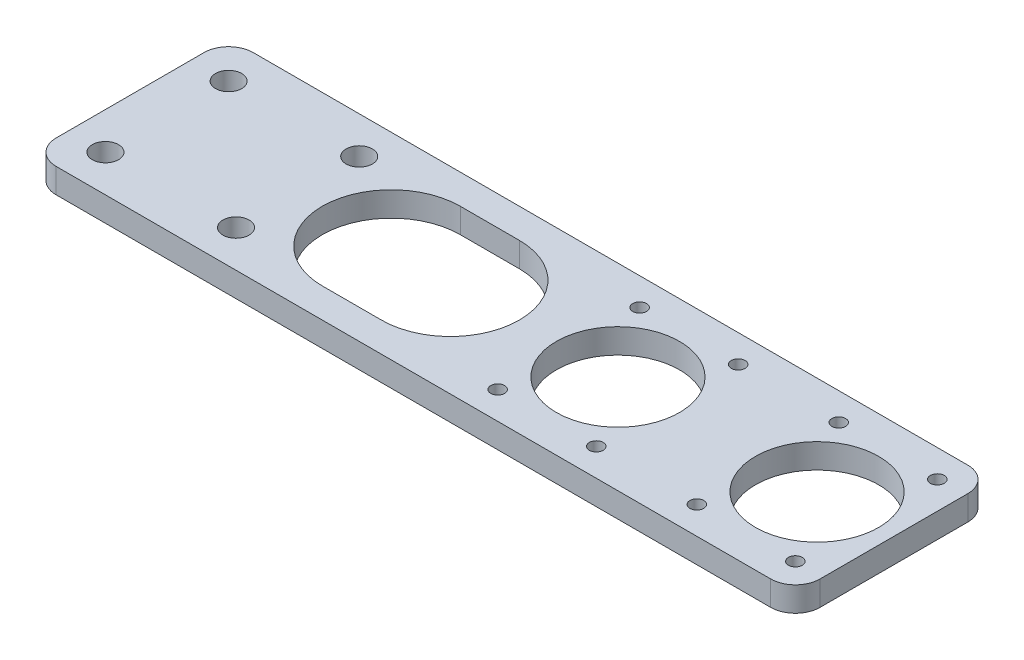
ISO-10303-21;
HEADER;
FILE_DESCRIPTION(('STEP AP214'),'2;1');
FILE_NAME('part.step','',(''),(''),'','','');
FILE_SCHEMA(('AUTOMOTIVE_DESIGN { 1 0 10303 214 1 1 1 1 }'));
ENDSEC;
DATA;
#1=APPLICATION_CONTEXT('core data for automotive mechanical design processes');
#2=APPLICATION_PROTOCOL_DEFINITION('international standard','automotive_design',2000,#1);
#3=PRODUCT_CONTEXT('',#1,'mechanical');
#4=PRODUCT('Part','Part','',(#3));
#5=PRODUCT_RELATED_PRODUCT_CATEGORY('part','',(#4));
#6=PRODUCT_DEFINITION_FORMATION('','',#4);
#7=PRODUCT_DEFINITION_CONTEXT('part definition',#1,'design');
#8=PRODUCT_DEFINITION('design','',#6,#7);
#9=PRODUCT_DEFINITION_SHAPE('','',#8);
#10=(LENGTH_UNIT() NAMED_UNIT(*) SI_UNIT(.MILLI.,.METRE.));
#11=(NAMED_UNIT(*) PLANE_ANGLE_UNIT() SI_UNIT($,.RADIAN.));
#12=(NAMED_UNIT(*) SI_UNIT($,.STERADIAN.) SOLID_ANGLE_UNIT());
#13=UNCERTAINTY_MEASURE_WITH_UNIT(LENGTH_MEASURE(1.E-05),#10,'distance_accuracy_value','');
#14=(GEOMETRIC_REPRESENTATION_CONTEXT(3) GLOBAL_UNCERTAINTY_ASSIGNED_CONTEXT((#13)) GLOBAL_UNIT_ASSIGNED_CONTEXT((#10,
#11,#12)) REPRESENTATION_CONTEXT('',''));
#15=CARTESIAN_POINT('',(0.,0.,0.));
#16=DIRECTION('',(0.,0.,1.));
#17=DIRECTION('',(1.,0.,0.));
#18=AXIS2_PLACEMENT_3D('',#15,#16,#17);
#19=CARTESIAN_POINT('',(77.47,6.35,-19.05));
#20=DIRECTION('',(0.,-1.,0.));
#21=DIRECTION('',(0.,0.,-1.));
#22=AXIS2_PLACEMENT_3D('',#19,#20,#21);
#23=PLANE('',#22);
#24=CARTESIAN_POINT('',(76.708,6.35,18.288));
#25=DIRECTION('',(0.,1.,0.));
#26=DIRECTION('',(0.,0.,1.));
#27=AXIS2_PLACEMENT_3D('',#24,#25,#26);
#28=CIRCLE('',#27,1.77800000000001);
#29=CARTESIAN_POINT('',(76.708,6.35,20.066));
#30=VERTEX_POINT('',#29);
#31=EDGE_CURVE('E183',#30,#30,#28,.T.);
#32=ORIENTED_EDGE('',*,*,#31,.F.);
#33=EDGE_LOOP('',(#32));
#34=FACE_BOUND('',#33,.T.);
#35=CARTESIAN_POINT('',(51.308,6.35,18.288));
#36=DIRECTION('',(0.,1.,0.));
#37=DIRECTION('',(0.,0.,1.));
#38=AXIS2_PLACEMENT_3D('',#35,#36,#37);
#39=CIRCLE('',#38,1.778);
#40=CARTESIAN_POINT('',(51.308,6.35,20.066));
#41=VERTEX_POINT('',#40);
#42=EDGE_CURVE('E189',#41,#41,#39,.T.);
#43=ORIENTED_EDGE('',*,*,#42,.F.);
#44=EDGE_LOOP('',(#43));
#45=FACE_BOUND('',#44,.T.);
#46=CARTESIAN_POINT('',(25.4,6.35,18.288));
#47=DIRECTION('',(0.,1.,0.));
#48=DIRECTION('',(0.,0.,1.));
#49=AXIS2_PLACEMENT_3D('',#46,#47,#48);
#50=CIRCLE('',#49,1.77800000000001);
#51=CARTESIAN_POINT('',(25.4,6.35,20.066));
#52=VERTEX_POINT('',#51);
#53=EDGE_CURVE('E195',#52,#52,#50,.T.);
#54=ORIENTED_EDGE('',*,*,#53,.F.);
#55=EDGE_LOOP('',(#54));
#56=FACE_BOUND('',#55,.T.);
#57=CARTESIAN_POINT('',(0.,6.35,18.288));
#58=DIRECTION('',(0.,1.,0.));
#59=DIRECTION('',(0.,0.,1.));
#60=AXIS2_PLACEMENT_3D('',#57,#58,#59);
#61=CIRCLE('',#60,1.778);
#62=CARTESIAN_POINT('',(0.,6.35,20.066));
#63=VERTEX_POINT('',#62);
#64=EDGE_CURVE('E201',#63,#63,#61,.T.);
#65=ORIENTED_EDGE('',*,*,#64,.F.);
#66=EDGE_LOOP('',(#65));
#67=FACE_BOUND('',#66,.T.);
#68=CARTESIAN_POINT('',(76.708,6.35,-18.288));
#69=DIRECTION('',(0.,1.,0.));
#70=DIRECTION('',(0.,0.,1.));
#71=AXIS2_PLACEMENT_3D('',#68,#69,#70);
#72=CIRCLE('',#71,1.77800000000001);
#73=CARTESIAN_POINT('',(76.708,6.35,-16.51));
#74=VERTEX_POINT('',#73);
#75=EDGE_CURVE('E207',#74,#74,#72,.T.);
#76=ORIENTED_EDGE('',*,*,#75,.F.);
#77=EDGE_LOOP('',(#76));
#78=FACE_BOUND('',#77,.T.);
#79=CARTESIAN_POINT('',(51.308,6.35,-18.288));
#80=DIRECTION('',(0.,1.,0.));
#81=DIRECTION('',(0.,0.,1.));
#82=AXIS2_PLACEMENT_3D('',#79,#80,#81);
#83=CIRCLE('',#82,1.778);
#84=CARTESIAN_POINT('',(51.308,6.35,-16.51));
#85=VERTEX_POINT('',#84);
#86=EDGE_CURVE('E213',#85,#85,#83,.T.);
#87=ORIENTED_EDGE('',*,*,#86,.F.);
#88=EDGE_LOOP('',(#87));
#89=FACE_BOUND('',#88,.T.);
#90=CARTESIAN_POINT('',(25.4,6.35,-18.288));
#91=DIRECTION('',(0.,1.,0.));
#92=DIRECTION('',(0.,0.,1.));
#93=AXIS2_PLACEMENT_3D('',#90,#91,#92);
#94=CIRCLE('',#93,1.77800000000001);
#95=CARTESIAN_POINT('',(25.4,6.35,-16.51));
#96=VERTEX_POINT('',#95);
#97=EDGE_CURVE('E219',#96,#96,#94,.T.);
#98=ORIENTED_EDGE('',*,*,#97,.F.);
#99=EDGE_LOOP('',(#98));
#100=FACE_BOUND('',#99,.T.);
#101=CARTESIAN_POINT('',(0.,6.35,-18.288));
#102=DIRECTION('',(0.,1.,0.));
#103=DIRECTION('',(0.,0.,1.));
#104=AXIS2_PLACEMENT_3D('',#101,#102,#103);
#105=CIRCLE('',#104,1.778);
#106=CARTESIAN_POINT('',(0.,6.35,-16.51));
#107=VERTEX_POINT('',#106);
#108=EDGE_CURVE('E225',#107,#107,#105,.T.);
#109=ORIENTED_EDGE('',*,*,#108,.F.);
#110=EDGE_LOOP('',(#109));
#111=FACE_BOUND('',#110,.T.);
#112=CARTESIAN_POINT('',(64.008,6.35,0.));
#113=DIRECTION('',(0.,1.,0.));
#114=DIRECTION('',(0.,0.,1.));
#115=AXIS2_PLACEMENT_3D('',#112,#113,#114);
#116=CIRCLE('',#115,15.875);
#117=CARTESIAN_POINT('',(64.008,6.35,15.875));
#118=VERTEX_POINT('',#117);
#119=EDGE_CURVE('E231',#118,#118,#116,.T.);
#120=ORIENTED_EDGE('',*,*,#119,.F.);
#121=EDGE_LOOP('',(#120));
#122=FACE_BOUND('',#121,.T.);
#123=CARTESIAN_POINT('',(12.7,6.35,0.));
#124=DIRECTION('',(0.,1.,0.));
#125=DIRECTION('',(0.,0.,1.));
#126=AXIS2_PLACEMENT_3D('',#123,#124,#125);
#127=CIRCLE('',#126,15.875);
#128=CARTESIAN_POINT('',(12.7,6.35,15.875));
#129=VERTEX_POINT('',#128);
#130=EDGE_CURVE('E237',#129,#129,#127,.T.);
#131=ORIENTED_EDGE('',*,*,#130,.F.);
#132=EDGE_LOOP('',(#131));
#133=FACE_BOUND('',#132,.T.);
#134=DIRECTION('',(0.,0.,1.));
#135=VECTOR('',#134,1.);
#136=CARTESIAN_POINT('',(-113.03,6.35,-25.4));
#137=LINE('',#136,#135);
#138=CARTESIAN_POINT('',(-113.03,6.35,-19.05));
#139=VERTEX_POINT('',#138);
#140=CARTESIAN_POINT('',(-113.03,6.35,19.05));
#141=VERTEX_POINT('',#140);
#142=EDGE_CURVE('E246',#139,#141,#137,.T.);
#143=ORIENTED_EDGE('',*,*,#142,.T.);
#144=CARTESIAN_POINT('',(-106.68,6.35,19.05));
#145=DIRECTION('',(0.,-1.,0.));
#146=DIRECTION('',(0.,0.,-1.));
#147=AXIS2_PLACEMENT_3D('',#144,#145,#146);
#148=CIRCLE('',#147,6.35);
#149=CARTESIAN_POINT('',(-106.68,6.35,25.4));
#150=VERTEX_POINT('',#149);
#151=EDGE_CURVE('E51',#141,#150,#148,.F.);
#152=ORIENTED_EDGE('',*,*,#151,.T.);
#153=DIRECTION('',(1.,0.,0.));
#154=VECTOR('',#153,1.);
#155=CARTESIAN_POINT('',(-113.03,6.35,25.4));
#156=LINE('',#155,#154);
#157=CARTESIAN_POINT('',(77.47,6.35,25.4));
#158=VERTEX_POINT('',#157);
#159=EDGE_CURVE('E250',#150,#158,#156,.T.);
#160=ORIENTED_EDGE('',*,*,#159,.T.);
#161=CARTESIAN_POINT('',(77.47,6.35,19.05));
#162=DIRECTION('',(0.,1.,0.));
#163=DIRECTION('',(0.,0.,1.));
#164=AXIS2_PLACEMENT_3D('',#161,#162,#163);
#165=CIRCLE('',#164,6.34999999999999);
#166=CARTESIAN_POINT('',(83.82,6.35,19.05));
#167=VERTEX_POINT('',#166);
#168=EDGE_CURVE('E252',#158,#167,#165,.T.);
#169=ORIENTED_EDGE('',*,*,#168,.T.);
#170=DIRECTION('',(0.,0.,-1.));
#171=VECTOR('',#170,1.);
#172=CARTESIAN_POINT('',(83.82,6.35,-19.05));
#173=LINE('',#172,#171);
#174=CARTESIAN_POINT('',(83.82,6.35,-19.05));
#175=VERTEX_POINT('',#174);
#176=EDGE_CURVE('E254',#167,#175,#173,.T.);
#177=ORIENTED_EDGE('',*,*,#176,.T.);
#178=CARTESIAN_POINT('',(77.47,6.35,-19.05));
#179=DIRECTION('',(0.,1.,0.));
#180=DIRECTION('',(0.,0.,-1.));
#181=AXIS2_PLACEMENT_3D('',#178,#179,#180);
#182=CIRCLE('',#181,6.35);
#183=CARTESIAN_POINT('',(77.47,6.35,-25.4));
#184=VERTEX_POINT('',#183);
#185=EDGE_CURVE('E256',#175,#184,#182,.T.);
#186=ORIENTED_EDGE('',*,*,#185,.T.);
#187=DIRECTION('',(-1.,0.,0.));
#188=VECTOR('',#187,1.);
#189=CARTESIAN_POINT('',(-113.03,6.35,-25.4));
#190=LINE('',#189,#188);
#191=CARTESIAN_POINT('',(-106.68,6.35,-25.4));
#192=VERTEX_POINT('',#191);
#193=EDGE_CURVE('E243',#184,#192,#190,.T.);
#194=ORIENTED_EDGE('',*,*,#193,.T.);
#195=CARTESIAN_POINT('',(-106.68,6.35,-19.05));
#196=DIRECTION('',(0.,-1.,0.));
#197=DIRECTION('',(0.,0.,-1.));
#198=AXIS2_PLACEMENT_3D('',#195,#196,#197);
#199=CIRCLE('',#198,6.35);
#200=EDGE_CURVE('E295',#192,#139,#199,.F.);
#201=ORIENTED_EDGE('',*,*,#200,.T.);
#202=EDGE_LOOP('',(#143,#152,#160,#169,#177,#186,#194,#201));
#203=FACE_BOUND('',#202,.T.);
#204=CARTESIAN_POINT('',(-30.48,6.35,0.));
#205=DIRECTION('',(0.,1.,0.));
#206=DIRECTION('',(0.,0.,1.));
#207=AXIS2_PLACEMENT_3D('',#204,#205,#206);
#208=CIRCLE('',#207,17.78);
#209=CARTESIAN_POINT('',(-30.48,6.35,17.78));
#210=VERTEX_POINT('',#209);
#211=CARTESIAN_POINT('',(-30.48,6.35,-17.78));
#212=VERTEX_POINT('',#211);
#213=EDGE_CURVE('E139',#210,#212,#208,.T.);
#214=ORIENTED_EDGE('',*,*,#213,.F.);
#215=DIRECTION('',(1.,0.,0.));
#216=VECTOR('',#215,1.);
#217=CARTESIAN_POINT('',(-30.48,6.35,17.78));
#218=LINE('',#217,#216);
#219=CARTESIAN_POINT('',(-45.72,6.35,17.78));
#220=VERTEX_POINT('',#219);
#221=EDGE_CURVE('E165',#220,#210,#218,.T.);
#222=ORIENTED_EDGE('',*,*,#221,.F.);
#223=CARTESIAN_POINT('',(-45.72,6.35,0.));
#224=DIRECTION('',(0.,1.,0.));
#225=DIRECTION('',(0.,0.,1.));
#226=AXIS2_PLACEMENT_3D('',#223,#224,#225);
#227=CIRCLE('',#226,17.78);
#228=CARTESIAN_POINT('',(-45.72,6.35,-17.78));
#229=VERTEX_POINT('',#228);
#230=EDGE_CURVE('E163',#229,#220,#227,.T.);
#231=ORIENTED_EDGE('',*,*,#230,.F.);
#232=DIRECTION('',(-1.,0.,0.));
#233=VECTOR('',#232,1.);
#234=CARTESIAN_POINT('',(-30.48,6.35,-17.78));
#235=LINE('',#234,#233);
#236=EDGE_CURVE('E149',#212,#229,#235,.T.);
#237=ORIENTED_EDGE('',*,*,#236,.F.);
#238=EDGE_LOOP('',(#214,#222,#231,#237));
#239=FACE_BOUND('',#238,.T.);
#240=CARTESIAN_POINT('',(-103.505,6.35,15.875));
#241=DIRECTION('',(0.,1.,0.));
#242=DIRECTION('',(0.,0.,1.));
#243=AXIS2_PLACEMENT_3D('',#240,#241,#242);
#244=CIRCLE('',#243,3.37819999999998);
#245=CARTESIAN_POINT('',(-103.505,6.35,19.2532));
#246=VERTEX_POINT('',#245);
#247=EDGE_CURVE('E461',#246,#246,#244,.T.);
#248=ORIENTED_EDGE('',*,*,#247,.F.);
#249=EDGE_LOOP('',(#248));
#250=FACE_BOUND('',#249,.T.);
#251=CARTESIAN_POINT('',(-69.85,6.35,15.875));
#252=DIRECTION('',(0.,1.,0.));
#253=DIRECTION('',(0.,0.,1.));
#254=AXIS2_PLACEMENT_3D('',#251,#252,#253);
#255=CIRCLE('',#254,3.37819999999998);
#256=CARTESIAN_POINT('',(-69.85,6.35,19.2532));
#257=VERTEX_POINT('',#256);
#258=EDGE_CURVE('E455',#257,#257,#255,.T.);
#259=ORIENTED_EDGE('',*,*,#258,.F.);
#260=EDGE_LOOP('',(#259));
#261=FACE_BOUND('',#260,.T.);
#262=CARTESIAN_POINT('',(-69.85,6.35,-15.875));
#263=DIRECTION('',(0.,1.,0.));
#264=DIRECTION('',(0.,0.,1.));
#265=AXIS2_PLACEMENT_3D('',#262,#263,#264);
#266=CIRCLE('',#265,3.37819999999998);
#267=CARTESIAN_POINT('',(-69.85,6.35,-12.4968));
#268=VERTEX_POINT('',#267);
#269=EDGE_CURVE('E443',#268,#268,#266,.T.);
#270=ORIENTED_EDGE('',*,*,#269,.F.);
#271=EDGE_LOOP('',(#270));
#272=FACE_BOUND('',#271,.T.);
#273=CARTESIAN_POINT('',(-103.505,6.35,-15.875));
#274=DIRECTION('',(0.,1.,0.));
#275=DIRECTION('',(0.,0.,1.));
#276=AXIS2_PLACEMENT_3D('',#273,#274,#275);
#277=CIRCLE('',#276,3.37819999999998);
#278=CARTESIAN_POINT('',(-103.505,6.35,-12.4968));
#279=VERTEX_POINT('',#278);
#280=EDGE_CURVE('E438',#279,#279,#277,.T.);
#281=ORIENTED_EDGE('',*,*,#280,.F.);
#282=EDGE_LOOP('',(#281));
#283=FACE_BOUND('',#282,.T.);
#284=ADVANCED_FACE('F42',(#34,#45,#56,#67,#78,#89,#100,#111,#122,#133,#203,#239,#250,#261,#272,
#283),#23,.F.);
#285=CARTESIAN_POINT('',(77.47,0.,-19.05));
#286=DIRECTION('',(0.,-1.,0.));
#287=DIRECTION('',(0.,0.,-1.));
#288=AXIS2_PLACEMENT_3D('',#285,#286,#287);
#289=PLANE('',#288);
#290=CARTESIAN_POINT('',(-103.505,0.,-15.875));
#291=DIRECTION('',(0.,-1.,0.));
#292=DIRECTION('',(0.,0.,-1.));
#293=AXIS2_PLACEMENT_3D('',#290,#291,#292);
#294=CIRCLE('',#293,3.37819999999999);
#295=CARTESIAN_POINT('',(-103.505,0.,-19.2532));
#296=VERTEX_POINT('',#295);
#297=EDGE_CURVE('E441',#296,#296,#294,.T.);
#298=ORIENTED_EDGE('',*,*,#297,.F.);
#299=EDGE_LOOP('',(#298));
#300=FACE_BOUND('',#299,.T.);
#301=CARTESIAN_POINT('',(-69.85,0.,-15.875));
#302=DIRECTION('',(0.,-1.,0.));
#303=DIRECTION('',(0.,0.,-1.));
#304=AXIS2_PLACEMENT_3D('',#301,#302,#303);
#305=CIRCLE('',#304,3.37819999999999);
#306=CARTESIAN_POINT('',(-69.85,0.,-19.2532));
#307=VERTEX_POINT('',#306);
#308=EDGE_CURVE('E447',#307,#307,#305,.T.);
#309=ORIENTED_EDGE('',*,*,#308,.F.);
#310=EDGE_LOOP('',(#309));
#311=FACE_BOUND('',#310,.T.);
#312=CARTESIAN_POINT('',(-69.85,0.,15.875));
#313=DIRECTION('',(0.,-1.,0.));
#314=DIRECTION('',(0.,0.,-1.));
#315=AXIS2_PLACEMENT_3D('',#312,#313,#314);
#316=CIRCLE('',#315,3.37819999999999);
#317=CARTESIAN_POINT('',(-69.85,0.,12.4968));
#318=VERTEX_POINT('',#317);
#319=EDGE_CURVE('E458',#318,#318,#316,.T.);
#320=ORIENTED_EDGE('',*,*,#319,.F.);
#321=EDGE_LOOP('',(#320));
#322=FACE_BOUND('',#321,.T.);
#323=CARTESIAN_POINT('',(-103.505,0.,15.875));
#324=DIRECTION('',(0.,-1.,0.));
#325=DIRECTION('',(0.,0.,-1.));
#326=AXIS2_PLACEMENT_3D('',#323,#324,#325);
#327=CIRCLE('',#326,3.37819999999999);
#328=CARTESIAN_POINT('',(-103.505,0.,12.4968));
#329=VERTEX_POINT('',#328);
#330=EDGE_CURVE('E172',#329,#329,#327,.T.);
#331=ORIENTED_EDGE('',*,*,#330,.F.);
#332=EDGE_LOOP('',(#331));
#333=FACE_BOUND('',#332,.T.);
#334=CARTESIAN_POINT('',(51.308,0.,18.288));
#335=DIRECTION('',(0.,1.,0.));
#336=DIRECTION('',(0.,0.,1.));
#337=AXIS2_PLACEMENT_3D('',#334,#335,#336);
#338=CIRCLE('',#337,1.778);
#339=CARTESIAN_POINT('',(51.308,0.,20.066));
#340=VERTEX_POINT('',#339);
#341=EDGE_CURVE('E186',#340,#340,#338,.T.);
#342=ORIENTED_EDGE('',*,*,#341,.T.);
#343=EDGE_LOOP('',(#342));
#344=FACE_BOUND('',#343,.T.);
#345=CARTESIAN_POINT('',(0.,0.,18.288));
#346=DIRECTION('',(0.,1.,0.));
#347=DIRECTION('',(0.,0.,1.));
#348=AXIS2_PLACEMENT_3D('',#345,#346,#347);
#349=CIRCLE('',#348,1.778);
#350=CARTESIAN_POINT('',(0.,0.,20.066));
#351=VERTEX_POINT('',#350);
#352=EDGE_CURVE('E198',#351,#351,#349,.T.);
#353=ORIENTED_EDGE('',*,*,#352,.T.);
#354=EDGE_LOOP('',(#353));
#355=FACE_BOUND('',#354,.T.);
#356=CARTESIAN_POINT('',(51.308,0.,-18.288));
#357=DIRECTION('',(0.,1.,0.));
#358=DIRECTION('',(0.,0.,1.));
#359=AXIS2_PLACEMENT_3D('',#356,#357,#358);
#360=CIRCLE('',#359,1.778);
#361=CARTESIAN_POINT('',(51.308,0.,-16.51));
#362=VERTEX_POINT('',#361);
#363=EDGE_CURVE('E210',#362,#362,#360,.T.);
#364=ORIENTED_EDGE('',*,*,#363,.T.);
#365=EDGE_LOOP('',(#364));
#366=FACE_BOUND('',#365,.T.);
#367=CARTESIAN_POINT('',(0.,0.,-18.288));
#368=DIRECTION('',(0.,1.,0.));
#369=DIRECTION('',(0.,0.,1.));
#370=AXIS2_PLACEMENT_3D('',#367,#368,#369);
#371=CIRCLE('',#370,1.778);
#372=CARTESIAN_POINT('',(0.,0.,-16.51));
#373=VERTEX_POINT('',#372);
#374=EDGE_CURVE('E222',#373,#373,#371,.T.);
#375=ORIENTED_EDGE('',*,*,#374,.T.);
#376=EDGE_LOOP('',(#375));
#377=FACE_BOUND('',#376,.T.);
#378=CARTESIAN_POINT('',(12.7,0.,0.));
#379=DIRECTION('',(0.,1.,0.));
#380=DIRECTION('',(0.,0.,1.));
#381=AXIS2_PLACEMENT_3D('',#378,#379,#380);
#382=CIRCLE('',#381,15.875);
#383=CARTESIAN_POINT('',(12.7,0.,15.875));
#384=VERTEX_POINT('',#383);
#385=EDGE_CURVE('E234',#384,#384,#382,.T.);
#386=ORIENTED_EDGE('',*,*,#385,.T.);
#387=EDGE_LOOP('',(#386));
#388=FACE_BOUND('',#387,.T.);
#389=DIRECTION('',(1.,0.,0.));
#390=VECTOR('',#389,1.);
#391=CARTESIAN_POINT('',(-113.03,0.,25.4));
#392=LINE('',#391,#390);
#393=CARTESIAN_POINT('',(-106.68,0.,25.4));
#394=VERTEX_POINT('',#393);
#395=CARTESIAN_POINT('',(77.47,0.,25.4));
#396=VERTEX_POINT('',#395);
#397=EDGE_CURVE('E264',#394,#396,#392,.T.);
#398=ORIENTED_EDGE('',*,*,#397,.F.);
#399=CARTESIAN_POINT('',(-106.68,0.,19.05));
#400=DIRECTION('',(0.,-1.,0.));
#401=DIRECTION('',(0.,0.,-1.));
#402=AXIS2_PLACEMENT_3D('',#399,#400,#401);
#403=CIRCLE('',#402,6.35);
#404=CARTESIAN_POINT('',(-113.03,0.,19.05));
#405=VERTEX_POINT('',#404);
#406=EDGE_CURVE('E288',#394,#405,#403,.T.);
#407=ORIENTED_EDGE('',*,*,#406,.T.);
#408=DIRECTION('',(0.,0.,1.));
#409=VECTOR('',#408,1.);
#410=CARTESIAN_POINT('',(-113.03,0.,-25.4));
#411=LINE('',#410,#409);
#412=CARTESIAN_POINT('',(-113.03,0.,-19.05));
#413=VERTEX_POINT('',#412);
#414=EDGE_CURVE('E261',#413,#405,#411,.T.);
#415=ORIENTED_EDGE('',*,*,#414,.F.);
#416=CARTESIAN_POINT('',(-106.68,0.,-19.05));
#417=DIRECTION('',(0.,-1.,0.));
#418=DIRECTION('',(0.,0.,-1.));
#419=AXIS2_PLACEMENT_3D('',#416,#417,#418);
#420=CIRCLE('',#419,6.35);
#421=CARTESIAN_POINT('',(-106.68,0.,-25.4));
#422=VERTEX_POINT('',#421);
#423=EDGE_CURVE('E285',#413,#422,#420,.T.);
#424=ORIENTED_EDGE('',*,*,#423,.T.);
#425=DIRECTION('',(-1.,0.,0.));
#426=VECTOR('',#425,1.);
#427=CARTESIAN_POINT('',(-113.03,0.,-25.4));
#428=LINE('',#427,#426);
#429=CARTESIAN_POINT('',(77.47,0.,-25.4));
#430=VERTEX_POINT('',#429);
#431=EDGE_CURVE('E240',#430,#422,#428,.T.);
#432=ORIENTED_EDGE('',*,*,#431,.F.);
#433=CARTESIAN_POINT('',(77.47,0.,-19.05));
#434=DIRECTION('',(0.,1.,0.));
#435=DIRECTION('',(0.,0.,-1.));
#436=AXIS2_PLACEMENT_3D('',#433,#434,#435);
#437=CIRCLE('',#436,6.35);
#438=CARTESIAN_POINT('',(83.82,0.,-19.05));
#439=VERTEX_POINT('',#438);
#440=EDGE_CURVE('E247',#439,#430,#437,.T.);
#441=ORIENTED_EDGE('',*,*,#440,.F.);
#442=DIRECTION('',(0.,0.,-1.));
#443=VECTOR('',#442,1.);
#444=CARTESIAN_POINT('',(83.82,0.,-19.05));
#445=LINE('',#444,#443);
#446=CARTESIAN_POINT('',(83.82,0.,19.05));
#447=VERTEX_POINT('',#446);
#448=EDGE_CURVE('E268',#447,#439,#445,.T.);
#449=ORIENTED_EDGE('',*,*,#448,.F.);
#450=CARTESIAN_POINT('',(77.47,0.,19.05));
#451=DIRECTION('',(0.,1.,0.));
#452=DIRECTION('',(0.,0.,1.));
#453=AXIS2_PLACEMENT_3D('',#450,#451,#452);
#454=CIRCLE('',#453,6.34999999999999);
#455=EDGE_CURVE('E266',#396,#447,#454,.T.);
#456=ORIENTED_EDGE('',*,*,#455,.F.);
#457=EDGE_LOOP('',(#398,#407,#415,#424,#432,#441,#449,#456));
#458=FACE_BOUND('',#457,.T.);
#459=CARTESIAN_POINT('',(64.008,0.,0.));
#460=DIRECTION('',(0.,1.,0.));
#461=DIRECTION('',(0.,0.,1.));
#462=AXIS2_PLACEMENT_3D('',#459,#460,#461);
#463=CIRCLE('',#462,15.875);
#464=CARTESIAN_POINT('',(64.008,0.,15.875));
#465=VERTEX_POINT('',#464);
#466=EDGE_CURVE('E228',#465,#465,#463,.T.);
#467=ORIENTED_EDGE('',*,*,#466,.T.);
#468=EDGE_LOOP('',(#467));
#469=FACE_BOUND('',#468,.T.);
#470=CARTESIAN_POINT('',(25.4,0.,-18.288));
#471=DIRECTION('',(0.,1.,0.));
#472=DIRECTION('',(0.,0.,1.));
#473=AXIS2_PLACEMENT_3D('',#470,#471,#472);
#474=CIRCLE('',#473,1.77800000000001);
#475=CARTESIAN_POINT('',(25.4,0.,-16.51));
#476=VERTEX_POINT('',#475);
#477=EDGE_CURVE('E216',#476,#476,#474,.T.);
#478=ORIENTED_EDGE('',*,*,#477,.T.);
#479=EDGE_LOOP('',(#478));
#480=FACE_BOUND('',#479,.T.);
#481=CARTESIAN_POINT('',(76.708,0.,-18.288));
#482=DIRECTION('',(0.,1.,0.));
#483=DIRECTION('',(0.,0.,1.));
#484=AXIS2_PLACEMENT_3D('',#481,#482,#483);
#485=CIRCLE('',#484,1.77800000000001);
#486=CARTESIAN_POINT('',(76.708,0.,-16.51));
#487=VERTEX_POINT('',#486);
#488=EDGE_CURVE('E204',#487,#487,#485,.T.);
#489=ORIENTED_EDGE('',*,*,#488,.T.);
#490=EDGE_LOOP('',(#489));
#491=FACE_BOUND('',#490,.T.);
#492=CARTESIAN_POINT('',(25.4,0.,18.288));
#493=DIRECTION('',(0.,1.,0.));
#494=DIRECTION('',(0.,0.,1.));
#495=AXIS2_PLACEMENT_3D('',#492,#493,#494);
#496=CIRCLE('',#495,1.77800000000001);
#497=CARTESIAN_POINT('',(25.4,0.,20.066));
#498=VERTEX_POINT('',#497);
#499=EDGE_CURVE('E192',#498,#498,#496,.T.);
#500=ORIENTED_EDGE('',*,*,#499,.T.);
#501=EDGE_LOOP('',(#500));
#502=FACE_BOUND('',#501,.T.);
#503=CARTESIAN_POINT('',(76.708,0.,18.288));
#504=DIRECTION('',(0.,1.,0.));
#505=DIRECTION('',(0.,0.,1.));
#506=AXIS2_PLACEMENT_3D('',#503,#504,#505);
#507=CIRCLE('',#506,1.77800000000001);
#508=CARTESIAN_POINT('',(76.708,0.,20.066));
#509=VERTEX_POINT('',#508);
#510=EDGE_CURVE('E157',#509,#509,#507,.T.);
#511=ORIENTED_EDGE('',*,*,#510,.T.);
#512=EDGE_LOOP('',(#511));
#513=FACE_BOUND('',#512,.T.);
#514=DIRECTION('',(1.,0.,0.));
#515=VECTOR('',#514,1.);
#516=CARTESIAN_POINT('',(-30.48,0.,17.78));
#517=LINE('',#516,#515);
#518=CARTESIAN_POINT('',(-45.72,0.,17.78));
#519=VERTEX_POINT('',#518);
#520=CARTESIAN_POINT('',(-30.48,0.,17.78));
#521=VERTEX_POINT('',#520);
#522=EDGE_CURVE('E150',#519,#521,#517,.T.);
#523=ORIENTED_EDGE('',*,*,#522,.T.);
#524=CARTESIAN_POINT('',(-30.48,0.,0.));
#525=DIRECTION('',(0.,1.,0.));
#526=DIRECTION('',(0.,0.,1.));
#527=AXIS2_PLACEMENT_3D('',#524,#525,#526);
#528=CIRCLE('',#527,17.78);
#529=CARTESIAN_POINT('',(-30.48,0.,-17.78));
#530=VERTEX_POINT('',#529);
#531=EDGE_CURVE('E170',#521,#530,#528,.T.);
#532=ORIENTED_EDGE('',*,*,#531,.T.);
#533=DIRECTION('',(-1.,0.,0.));
#534=VECTOR('',#533,1.);
#535=CARTESIAN_POINT('',(-30.48,0.,-17.78));
#536=LINE('',#535,#534);
#537=CARTESIAN_POINT('',(-45.72,0.,-17.78));
#538=VERTEX_POINT('',#537);
#539=EDGE_CURVE('E156',#530,#538,#536,.T.);
#540=ORIENTED_EDGE('',*,*,#539,.T.);
#541=CARTESIAN_POINT('',(-45.72,0.,0.));
#542=DIRECTION('',(0.,1.,0.));
#543=DIRECTION('',(0.,0.,1.));
#544=AXIS2_PLACEMENT_3D('',#541,#542,#543);
#545=CIRCLE('',#544,17.78);
#546=EDGE_CURVE('E174',#538,#519,#545,.T.);
#547=ORIENTED_EDGE('',*,*,#546,.T.);
#548=EDGE_LOOP('',(#523,#532,#540,#547));
#549=FACE_BOUND('',#548,.T.);
#550=ADVANCED_FACE('F310',(#300,#311,#322,#333,#344,#355,#366,#377,#388,#458,#469,#480,#491,
#502,#513,#549),#289,.T.);
#551=CARTESIAN_POINT('',(-113.03,6.35,-25.4));
#552=DIRECTION('',(0.,0.,1.));
#553=DIRECTION('',(1.,0.,0.));
#554=AXIS2_PLACEMENT_3D('',#551,#552,#553);
#555=PLANE('',#554);
#556=ORIENTED_EDGE('',*,*,#431,.T.);
#557=DIRECTION('',(0.,-1.,0.));
#558=VECTOR('',#557,1.);
#559=CARTESIAN_POINT('',(-106.68,6.35,-25.4));
#560=LINE('',#559,#558);
#561=EDGE_CURVE('E11',#422,#192,#560,.F.);
#562=ORIENTED_EDGE('',*,*,#561,.T.);
#563=ORIENTED_EDGE('',*,*,#193,.F.);
#564=DIRECTION('',(0.,-1.,0.));
#565=VECTOR('',#564,1.);
#566=CARTESIAN_POINT('',(77.47,6.35,-25.4));
#567=LINE('',#566,#565);
#568=EDGE_CURVE('E258',#184,#430,#567,.T.);
#569=ORIENTED_EDGE('',*,*,#568,.T.);
#570=EDGE_LOOP('',(#556,#562,#563,#569));
#571=FACE_BOUND('',#570,.T.);
#572=ADVANCED_FACE('F319',(#571),#555,.F.);
#573=CARTESIAN_POINT('',(-113.03,6.35,-25.4));
#574=DIRECTION('',(1.,0.,0.));
#575=DIRECTION('',(0.,0.,-1.));
#576=AXIS2_PLACEMENT_3D('',#573,#574,#575);
#577=PLANE('',#576);
#578=ORIENTED_EDGE('',*,*,#414,.T.);
#579=DIRECTION('',(0.,-1.,0.));
#580=VECTOR('',#579,1.);
#581=CARTESIAN_POINT('',(-113.03,6.35,19.05));
#582=LINE('',#581,#580);
#583=EDGE_CURVE('E67',#405,#141,#582,.F.);
#584=ORIENTED_EDGE('',*,*,#583,.T.);
#585=ORIENTED_EDGE('',*,*,#142,.F.);
#586=DIRECTION('',(0.,-1.,0.));
#587=VECTOR('',#586,1.);
#588=CARTESIAN_POINT('',(-113.03,6.35,-19.05));
#589=LINE('',#588,#587);
#590=EDGE_CURVE('E290',#139,#413,#589,.T.);
#591=ORIENTED_EDGE('',*,*,#590,.T.);
#592=EDGE_LOOP('',(#578,#584,#585,#591));
#593=FACE_BOUND('',#592,.T.);
#594=ADVANCED_FACE('F313',(#593),#577,.F.);
#595=CARTESIAN_POINT('',(-113.03,6.35,25.4));
#596=DIRECTION('',(0.,0.,-1.));
#597=DIRECTION('',(-1.,0.,0.));
#598=AXIS2_PLACEMENT_3D('',#595,#596,#597);
#599=PLANE('',#598);
#600=ORIENTED_EDGE('',*,*,#159,.F.);
#601=DIRECTION('',(0.,-1.,0.));
#602=VECTOR('',#601,1.);
#603=CARTESIAN_POINT('',(-106.68,6.35,25.4));
#604=LINE('',#603,#602);
#605=EDGE_CURVE('E282',#150,#394,#604,.T.);
#606=ORIENTED_EDGE('',*,*,#605,.T.);
#607=ORIENTED_EDGE('',*,*,#397,.T.);
#608=DIRECTION('',(0.,-1.,0.));
#609=VECTOR('',#608,1.);
#610=CARTESIAN_POINT('',(77.47,6.35,25.4));
#611=LINE('',#610,#609);
#612=EDGE_CURVE('E279',#158,#396,#611,.T.);
#613=ORIENTED_EDGE('',*,*,#612,.F.);
#614=EDGE_LOOP('',(#600,#606,#607,#613));
#615=FACE_BOUND('',#614,.T.);
#616=ADVANCED_FACE('F304',(#615),#599,.F.);
#617=CARTESIAN_POINT('',(77.47,6.35,19.05));
#618=DIRECTION('',(0.,-1.,0.));
#619=DIRECTION('',(0.,0.,-1.));
#620=AXIS2_PLACEMENT_3D('',#617,#618,#619);
#621=CYLINDRICAL_SURFACE('',#620,6.34999999999999);
#622=ORIENTED_EDGE('',*,*,#455,.T.);
#623=DIRECTION('',(0.,-1.,0.));
#624=VECTOR('',#623,1.);
#625=CARTESIAN_POINT('',(83.82,6.35,19.05));
#626=LINE('',#625,#624);
#627=EDGE_CURVE('E276',#167,#447,#626,.T.);
#628=ORIENTED_EDGE('',*,*,#627,.F.);
#629=ORIENTED_EDGE('',*,*,#168,.F.);
#630=ORIENTED_EDGE('',*,*,#612,.T.);
#631=EDGE_LOOP('',(#622,#628,#629,#630));
#632=FACE_BOUND('',#631,.T.);
#633=ADVANCED_FACE('F331',(#632),#621,.T.);
#634=CARTESIAN_POINT('',(83.82,6.35,-19.05));
#635=DIRECTION('',(-1.,0.,0.));
#636=DIRECTION('',(0.,0.,1.));
#637=AXIS2_PLACEMENT_3D('',#634,#635,#636);
#638=PLANE('',#637);
#639=ORIENTED_EDGE('',*,*,#448,.T.);
#640=DIRECTION('',(0.,-1.,0.));
#641=VECTOR('',#640,1.);
#642=CARTESIAN_POINT('',(83.82,6.35,-19.05));
#643=LINE('',#642,#641);
#644=EDGE_CURVE('E273',#175,#439,#643,.T.);
#645=ORIENTED_EDGE('',*,*,#644,.F.);
#646=ORIENTED_EDGE('',*,*,#176,.F.);
#647=ORIENTED_EDGE('',*,*,#627,.T.);
#648=EDGE_LOOP('',(#639,#645,#646,#647));
#649=FACE_BOUND('',#648,.T.);
#650=ADVANCED_FACE('F327',(#649),#638,.F.);
#651=CARTESIAN_POINT('',(77.47,6.35,-19.05));
#652=DIRECTION('',(0.,-1.,0.));
#653=DIRECTION('',(0.,0.,-1.));
#654=AXIS2_PLACEMENT_3D('',#651,#652,#653);
#655=CYLINDRICAL_SURFACE('',#654,6.35);
#656=ORIENTED_EDGE('',*,*,#440,.T.);
#657=ORIENTED_EDGE('',*,*,#568,.F.);
#658=ORIENTED_EDGE('',*,*,#185,.F.);
#659=ORIENTED_EDGE('',*,*,#644,.T.);
#660=EDGE_LOOP('',(#656,#657,#658,#659));
#661=FACE_BOUND('',#660,.T.);
#662=ADVANCED_FACE('F323',(#661),#655,.T.);
#663=CARTESIAN_POINT('',(12.7,6.35,0.));
#664=DIRECTION('',(0.,-1.,0.));
#665=DIRECTION('',(0.,0.,-1.));
#666=AXIS2_PLACEMENT_3D('',#663,#664,#665);
#667=CYLINDRICAL_SURFACE('',#666,15.875);
#668=ORIENTED_EDGE('',*,*,#130,.T.);
#669=EDGE_LOOP('',(#668));
#670=FACE_BOUND('',#669,.T.);
#671=ORIENTED_EDGE('',*,*,#385,.F.);
#672=EDGE_LOOP('',(#671));
#673=FACE_BOUND('',#672,.T.);
#674=ADVANCED_FACE('F351',(#670,#673),#667,.F.);
#675=CARTESIAN_POINT('',(64.008,6.35,0.));
#676=DIRECTION('',(0.,-1.,0.));
#677=DIRECTION('',(0.,0.,-1.));
#678=AXIS2_PLACEMENT_3D('',#675,#676,#677);
#679=CYLINDRICAL_SURFACE('',#678,15.875);
#680=ORIENTED_EDGE('',*,*,#119,.T.);
#681=EDGE_LOOP('',(#680));
#682=FACE_BOUND('',#681,.T.);
#683=ORIENTED_EDGE('',*,*,#466,.F.);
#684=EDGE_LOOP('',(#683));
#685=FACE_BOUND('',#684,.T.);
#686=ADVANCED_FACE('F358',(#682,#685),#679,.F.);
#687=CARTESIAN_POINT('',(0.,6.35,-18.288));
#688=DIRECTION('',(0.,-1.,0.));
#689=DIRECTION('',(0.,0.,-1.));
#690=AXIS2_PLACEMENT_3D('',#687,#688,#689);
#691=CYLINDRICAL_SURFACE('',#690,1.778);
#692=ORIENTED_EDGE('',*,*,#108,.T.);
#693=EDGE_LOOP('',(#692));
#694=FACE_BOUND('',#693,.T.);
#695=ORIENTED_EDGE('',*,*,#374,.F.);
#696=EDGE_LOOP('',(#695));
#697=FACE_BOUND('',#696,.T.);
#698=ADVANCED_FACE('F363',(#694,#697),#691,.F.);
#699=CARTESIAN_POINT('',(25.4,6.35,-18.288));
#700=DIRECTION('',(0.,-1.,0.));
#701=DIRECTION('',(0.,0.,-1.));
#702=AXIS2_PLACEMENT_3D('',#699,#700,#701);
#703=CYLINDRICAL_SURFACE('',#702,1.77800000000001);
#704=ORIENTED_EDGE('',*,*,#97,.T.);
#705=EDGE_LOOP('',(#704));
#706=FACE_BOUND('',#705,.T.);
#707=ORIENTED_EDGE('',*,*,#477,.F.);
#708=EDGE_LOOP('',(#707));
#709=FACE_BOUND('',#708,.T.);
#710=ADVANCED_FACE('F373',(#706,#709),#703,.F.);
#711=CARTESIAN_POINT('',(51.308,6.35,-18.288));
#712=DIRECTION('',(0.,-1.,0.));
#713=DIRECTION('',(0.,0.,-1.));
#714=AXIS2_PLACEMENT_3D('',#711,#712,#713);
#715=CYLINDRICAL_SURFACE('',#714,1.778);
#716=ORIENTED_EDGE('',*,*,#86,.T.);
#717=EDGE_LOOP('',(#716));
#718=FACE_BOUND('',#717,.T.);
#719=ORIENTED_EDGE('',*,*,#363,.F.);
#720=EDGE_LOOP('',(#719));
#721=FACE_BOUND('',#720,.T.);
#722=ADVANCED_FACE('F380',(#718,#721),#715,.F.);
#723=CARTESIAN_POINT('',(76.708,6.35,-18.288));
#724=DIRECTION('',(0.,-1.,0.));
#725=DIRECTION('',(0.,0.,-1.));
#726=AXIS2_PLACEMENT_3D('',#723,#724,#725);
#727=CYLINDRICAL_SURFACE('',#726,1.77800000000001);
#728=ORIENTED_EDGE('',*,*,#75,.T.);
#729=EDGE_LOOP('',(#728));
#730=FACE_BOUND('',#729,.T.);
#731=ORIENTED_EDGE('',*,*,#488,.F.);
#732=EDGE_LOOP('',(#731));
#733=FACE_BOUND('',#732,.T.);
#734=ADVANCED_FACE('F384',(#730,#733),#727,.F.);
#735=CARTESIAN_POINT('',(0.,6.35,18.288));
#736=DIRECTION('',(0.,-1.,0.));
#737=DIRECTION('',(0.,0.,-1.));
#738=AXIS2_PLACEMENT_3D('',#735,#736,#737);
#739=CYLINDRICAL_SURFACE('',#738,1.778);
#740=ORIENTED_EDGE('',*,*,#64,.T.);
#741=EDGE_LOOP('',(#740));
#742=FACE_BOUND('',#741,.T.);
#743=ORIENTED_EDGE('',*,*,#352,.F.);
#744=EDGE_LOOP('',(#743));
#745=FACE_BOUND('',#744,.T.);
#746=ADVANCED_FACE('F388',(#742,#745),#739,.F.);
#747=CARTESIAN_POINT('',(25.4,6.35,18.288));
#748=DIRECTION('',(0.,-1.,0.));
#749=DIRECTION('',(0.,0.,-1.));
#750=AXIS2_PLACEMENT_3D('',#747,#748,#749);
#751=CYLINDRICAL_SURFACE('',#750,1.77800000000001);
#752=ORIENTED_EDGE('',*,*,#53,.T.);
#753=EDGE_LOOP('',(#752));
#754=FACE_BOUND('',#753,.T.);
#755=ORIENTED_EDGE('',*,*,#499,.F.);
#756=EDGE_LOOP('',(#755));
#757=FACE_BOUND('',#756,.T.);
#758=ADVANCED_FACE('F392',(#754,#757),#751,.F.);
#759=CARTESIAN_POINT('',(51.308,6.35,18.288));
#760=DIRECTION('',(0.,-1.,0.));
#761=DIRECTION('',(0.,0.,-1.));
#762=AXIS2_PLACEMENT_3D('',#759,#760,#761);
#763=CYLINDRICAL_SURFACE('',#762,1.778);
#764=ORIENTED_EDGE('',*,*,#42,.T.);
#765=EDGE_LOOP('',(#764));
#766=FACE_BOUND('',#765,.T.);
#767=ORIENTED_EDGE('',*,*,#341,.F.);
#768=EDGE_LOOP('',(#767));
#769=FACE_BOUND('',#768,.T.);
#770=ADVANCED_FACE('F396',(#766,#769),#763,.F.);
#771=CARTESIAN_POINT('',(76.708,6.35,18.288));
#772=DIRECTION('',(0.,-1.,0.));
#773=DIRECTION('',(0.,0.,-1.));
#774=AXIS2_PLACEMENT_3D('',#771,#772,#773);
#775=CYLINDRICAL_SURFACE('',#774,1.77800000000001);
#776=ORIENTED_EDGE('',*,*,#31,.T.);
#777=EDGE_LOOP('',(#776));
#778=FACE_BOUND('',#777,.T.);
#779=ORIENTED_EDGE('',*,*,#510,.F.);
#780=EDGE_LOOP('',(#779));
#781=FACE_BOUND('',#780,.T.);
#782=ADVANCED_FACE('F400',(#778,#781),#775,.F.);
#783=CARTESIAN_POINT('',(-30.48,6.35,0.));
#784=DIRECTION('',(0.,-1.,0.));
#785=DIRECTION('',(0.,0.,-1.));
#786=AXIS2_PLACEMENT_3D('',#783,#784,#785);
#787=CYLINDRICAL_SURFACE('',#786,17.78);
#788=ORIENTED_EDGE('',*,*,#531,.F.);
#789=DIRECTION('',(0.,-1.,0.));
#790=VECTOR('',#789,1.);
#791=CARTESIAN_POINT('',(-30.48,6.35,17.78));
#792=LINE('',#791,#790);
#793=EDGE_CURVE('E145',#210,#521,#792,.T.);
#794=ORIENTED_EDGE('',*,*,#793,.F.);
#795=ORIENTED_EDGE('',*,*,#213,.T.);
#796=DIRECTION('',(0.,-1.,0.));
#797=VECTOR('',#796,1.);
#798=CARTESIAN_POINT('',(-30.48,6.35,-17.78));
#799=LINE('',#798,#797);
#800=EDGE_CURVE('E142',#212,#530,#799,.T.);
#801=ORIENTED_EDGE('',*,*,#800,.T.);
#802=EDGE_LOOP('',(#788,#794,#795,#801));
#803=FACE_BOUND('',#802,.T.);
#804=ADVANCED_FACE('F141',(#803),#787,.F.);
#805=CARTESIAN_POINT('',(-30.48,6.35,-17.78));
#806=DIRECTION('',(0.,0.,1.));
#807=DIRECTION('',(1.,0.,0.));
#808=AXIS2_PLACEMENT_3D('',#805,#806,#807);
#809=PLANE('',#808);
#810=ORIENTED_EDGE('',*,*,#539,.F.);
#811=ORIENTED_EDGE('',*,*,#800,.F.);
#812=ORIENTED_EDGE('',*,*,#236,.T.);
#813=DIRECTION('',(0.,-1.,0.));
#814=VECTOR('',#813,1.);
#815=CARTESIAN_POINT('',(-45.72,6.35,-17.78));
#816=LINE('',#815,#814);
#817=EDGE_CURVE('E158',#229,#538,#816,.T.);
#818=ORIENTED_EDGE('',*,*,#817,.T.);
#819=EDGE_LOOP('',(#810,#811,#812,#818));
#820=FACE_BOUND('',#819,.T.);
#821=ADVANCED_FACE('F153',(#820),#809,.T.);
#822=CARTESIAN_POINT('',(-45.72,6.35,0.));
#823=DIRECTION('',(0.,-1.,0.));
#824=DIRECTION('',(0.,0.,-1.));
#825=AXIS2_PLACEMENT_3D('',#822,#823,#824);
#826=CYLINDRICAL_SURFACE('',#825,17.78);
#827=ORIENTED_EDGE('',*,*,#546,.F.);
#828=ORIENTED_EDGE('',*,*,#817,.F.);
#829=ORIENTED_EDGE('',*,*,#230,.T.);
#830=DIRECTION('',(0.,-1.,0.));
#831=VECTOR('',#830,1.);
#832=CARTESIAN_POINT('',(-45.72,6.35,17.78));
#833=LINE('',#832,#831);
#834=EDGE_CURVE('E180',#220,#519,#833,.T.);
#835=ORIENTED_EDGE('',*,*,#834,.T.);
#836=EDGE_LOOP('',(#827,#828,#829,#835));
#837=FACE_BOUND('',#836,.T.);
#838=ADVANCED_FACE('F409',(#837),#826,.F.);
#839=CARTESIAN_POINT('',(-30.48,6.35,17.78));
#840=DIRECTION('',(0.,0.,-1.));
#841=DIRECTION('',(-1.,0.,0.));
#842=AXIS2_PLACEMENT_3D('',#839,#840,#841);
#843=PLANE('',#842);
#844=ORIENTED_EDGE('',*,*,#522,.F.);
#845=ORIENTED_EDGE('',*,*,#834,.F.);
#846=ORIENTED_EDGE('',*,*,#221,.T.);
#847=ORIENTED_EDGE('',*,*,#793,.T.);
#848=EDGE_LOOP('',(#844,#845,#846,#847));
#849=FACE_BOUND('',#848,.T.);
#850=ADVANCED_FACE('F412',(#849),#843,.T.);
#851=CARTESIAN_POINT('',(-103.505,6.35,15.875));
#852=DIRECTION('',(0.,1.,0.));
#853=DIRECTION('',(0.,0.,1.));
#854=AXIS2_PLACEMENT_3D('',#851,#852,#853);
#855=CYLINDRICAL_SURFACE('',#854,3.37819999999999);
#856=ORIENTED_EDGE('',*,*,#247,.T.);
#857=EDGE_LOOP('',(#856));
#858=FACE_BOUND('',#857,.T.);
#859=ORIENTED_EDGE('',*,*,#330,.T.);
#860=EDGE_LOOP('',(#859));
#861=FACE_BOUND('',#860,.T.);
#862=ADVANCED_FACE('F416',(#858,#861),#855,.F.);
#863=CARTESIAN_POINT('',(-69.85,6.35,15.875));
#864=DIRECTION('',(0.,1.,0.));
#865=DIRECTION('',(0.,0.,1.));
#866=AXIS2_PLACEMENT_3D('',#863,#864,#865);
#867=CYLINDRICAL_SURFACE('',#866,3.37819999999999);
#868=ORIENTED_EDGE('',*,*,#258,.T.);
#869=EDGE_LOOP('',(#868));
#870=FACE_BOUND('',#869,.T.);
#871=ORIENTED_EDGE('',*,*,#319,.T.);
#872=EDGE_LOOP('',(#871));
#873=FACE_BOUND('',#872,.T.);
#874=ADVANCED_FACE('F420',(#870,#873),#867,.F.);
#875=CARTESIAN_POINT('',(-69.85,6.35,-15.875));
#876=DIRECTION('',(0.,1.,0.));
#877=DIRECTION('',(0.,0.,1.));
#878=AXIS2_PLACEMENT_3D('',#875,#876,#877);
#879=CYLINDRICAL_SURFACE('',#878,3.37819999999999);
#880=ORIENTED_EDGE('',*,*,#269,.T.);
#881=EDGE_LOOP('',(#880));
#882=FACE_BOUND('',#881,.T.);
#883=ORIENTED_EDGE('',*,*,#308,.T.);
#884=EDGE_LOOP('',(#883));
#885=FACE_BOUND('',#884,.T.);
#886=ADVANCED_FACE('F424',(#882,#885),#879,.F.);
#887=CARTESIAN_POINT('',(-103.505,6.35,-15.875));
#888=DIRECTION('',(0.,1.,0.));
#889=DIRECTION('',(0.,0.,1.));
#890=AXIS2_PLACEMENT_3D('',#887,#888,#889);
#891=CYLINDRICAL_SURFACE('',#890,3.37819999999999);
#892=ORIENTED_EDGE('',*,*,#280,.T.);
#893=EDGE_LOOP('',(#892));
#894=FACE_BOUND('',#893,.T.);
#895=ORIENTED_EDGE('',*,*,#297,.T.);
#896=EDGE_LOOP('',(#895));
#897=FACE_BOUND('',#896,.T.);
#898=ADVANCED_FACE('F428',(#894,#897),#891,.F.);
#899=CARTESIAN_POINT('',(-106.68,6.35,19.05));
#900=DIRECTION('',(0.,-1.,0.));
#901=DIRECTION('',(0.,0.,-1.));
#902=AXIS2_PLACEMENT_3D('',#899,#900,#901);
#903=CYLINDRICAL_SURFACE('',#902,6.35);
#904=ORIENTED_EDGE('',*,*,#151,.F.);
#905=ORIENTED_EDGE('',*,*,#583,.F.);
#906=ORIENTED_EDGE('',*,*,#406,.F.);
#907=ORIENTED_EDGE('',*,*,#605,.F.);
#908=EDGE_LOOP('',(#904,#905,#906,#907));
#909=FACE_BOUND('',#908,.T.);
#910=ADVANCED_FACE('F307',(#909),#903,.T.);
#911=CARTESIAN_POINT('',(-106.68,6.35,-19.05));
#912=DIRECTION('',(0.,-1.,0.));
#913=DIRECTION('',(0.,0.,-1.));
#914=AXIS2_PLACEMENT_3D('',#911,#912,#913);
#915=CYLINDRICAL_SURFACE('',#914,6.35);
#916=ORIENTED_EDGE('',*,*,#200,.F.);
#917=ORIENTED_EDGE('',*,*,#561,.F.);
#918=ORIENTED_EDGE('',*,*,#423,.F.);
#919=ORIENTED_EDGE('',*,*,#590,.F.);
#920=EDGE_LOOP('',(#916,#917,#918,#919));
#921=FACE_BOUND('',#920,.T.);
#922=ADVANCED_FACE('F44',(#921),#915,.T.);
#923=CLOSED_SHELL('',(#284,#550,#572,#594,#616,#633,#650,#662,#674,#686,#698,#710,#722,#734,
#746,#758,#770,#782,#804,#821,#838,#850,#862,#874,#886,#898,#910,#922));
#924=MANIFOLD_SOLID_BREP('B2',#923);
#925=ADVANCED_BREP_SHAPE_REPRESENTATION('',(#18,#924),#14);
#926=SHAPE_DEFINITION_REPRESENTATION(#9,#925);
ENDSEC;
END-ISO-10303-21;
